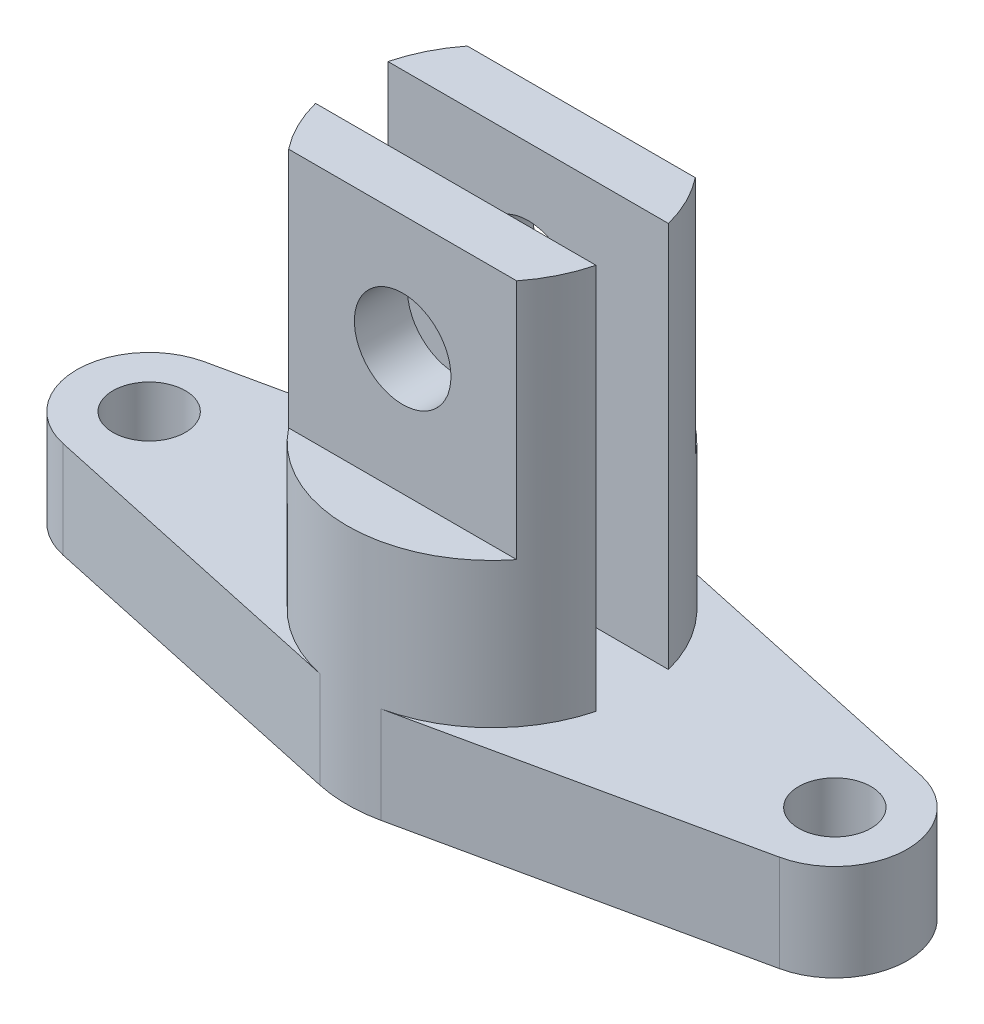
ISO-10303-21;
HEADER;
FILE_DESCRIPTION(('STEP AP214'),'2;1');
FILE_NAME('part.step','',(''),(''),'','','');
FILE_SCHEMA(('AUTOMOTIVE_DESIGN { 1 0 10303 214 1 1 1 1 }'));
ENDSEC;
DATA;
#1=APPLICATION_CONTEXT('core data for automotive mechanical design processes');
#2=APPLICATION_PROTOCOL_DEFINITION('international standard','automotive_design',2000,#1);
#3=PRODUCT_CONTEXT('',#1,'mechanical');
#4=PRODUCT('Part','Part','',(#3));
#5=PRODUCT_RELATED_PRODUCT_CATEGORY('part','',(#4));
#6=PRODUCT_DEFINITION_FORMATION('','',#4);
#7=PRODUCT_DEFINITION_CONTEXT('part definition',#1,'design');
#8=PRODUCT_DEFINITION('design','',#6,#7);
#9=PRODUCT_DEFINITION_SHAPE('','',#8);
#10=(LENGTH_UNIT() NAMED_UNIT(*) SI_UNIT(.MILLI.,.METRE.));
#11=(NAMED_UNIT(*) PLANE_ANGLE_UNIT() SI_UNIT($,.RADIAN.));
#12=(NAMED_UNIT(*) SI_UNIT($,.STERADIAN.) SOLID_ANGLE_UNIT());
#13=UNCERTAINTY_MEASURE_WITH_UNIT(LENGTH_MEASURE(1.E-05),#10,'distance_accuracy_value','');
#14=(GEOMETRIC_REPRESENTATION_CONTEXT(3) GLOBAL_UNCERTAINTY_ASSIGNED_CONTEXT((#13)) GLOBAL_UNIT_ASSIGNED_CONTEXT((#10,
#11,#12)) REPRESENTATION_CONTEXT('',''));
#15=CARTESIAN_POINT('',(0.,0.,0.));
#16=DIRECTION('',(0.,0.,1.));
#17=DIRECTION('',(1.,0.,0.));
#18=AXIS2_PLACEMENT_3D('',#15,#16,#17);
#19=CARTESIAN_POINT('',(71.,20.,-30.6927897427505));
#20=DIRECTION('',(0.,1.,0.));
#21=DIRECTION('',(0.,0.,1.));
#22=AXIS2_PLACEMENT_3D('',#19,#20,#21);
#23=PLANE('',#22);
#24=CARTESIAN_POINT('',(71.,20.,-30.6927897427505));
#25=DIRECTION('',(0.,1.,0.));
#26=DIRECTION('',(0.,0.,1.));
#27=AXIS2_PLACEMENT_3D('',#24,#25,#26);
#28=CIRCLE('',#27,7.50000000000001);
#29=CARTESIAN_POINT('',(71.,20.,-23.1927897427505));
#30=VERTEX_POINT('',#29);
#31=EDGE_CURVE('E221',#30,#30,#28,.T.);
#32=ORIENTED_EDGE('',*,*,#31,.F.);
#33=EDGE_LOOP('',(#32));
#34=FACE_BOUND('',#33,.T.);
#35=CARTESIAN_POINT('',(-71.,20.,-30.6927897427505));
#36=DIRECTION('',(0.,1.,0.));
#37=DIRECTION('',(0.,0.,1.));
#38=AXIS2_PLACEMENT_3D('',#35,#36,#37);
#39=CIRCLE('',#38,7.50000000000001);
#40=CARTESIAN_POINT('',(-71.,20.,-23.1927897427505));
#41=VERTEX_POINT('',#40);
#42=EDGE_CURVE('E215',#41,#41,#39,.T.);
#43=ORIENTED_EDGE('',*,*,#42,.F.);
#44=EDGE_LOOP('',(#43));
#45=FACE_BOUND('',#44,.T.);
#46=DIRECTION('',(1.,0.,0.));
#47=VECTOR('',#46,1.);
#48=CARTESIAN_POINT('',(-29.0473750965556,20.,-38.1927897427505));
#49=LINE('',#48,#47);
#50=CARTESIAN_POINT('',(-29.0473750965556,20.,-38.1927897427505));
#51=VERTEX_POINT('',#50);
#52=CARTESIAN_POINT('',(29.0473750965556,20.,-38.1927897427505));
#53=VERTEX_POINT('',#52);
#54=EDGE_CURVE('E190',#51,#53,#49,.T.);
#55=ORIENTED_EDGE('',*,*,#54,.F.);
#56=CARTESIAN_POINT('',(0.,20.,-30.6927897427505));
#57=DIRECTION('',(0.,1.,0.));
#58=DIRECTION('',(0.,0.,1.));
#59=AXIS2_PLACEMENT_3D('',#56,#57,#58);
#60=CIRCLE('',#59,30.);
#61=CARTESIAN_POINT('',(-6.33802816901409,20.,-60.0156374715913));
#62=VERTEX_POINT('',#61);
#63=EDGE_CURVE('E165',#62,#51,#60,.T.);
#64=ORIENTED_EDGE('',*,*,#63,.F.);
#65=DIRECTION('',(-0.977428257628027,0.,0.211267605633803));
#66=VECTOR('',#65,1.);
#67=CARTESIAN_POINT('',(-6.33802816901409,20.,-60.0156374715913));
#68=LINE('',#67,#66);
#69=CARTESIAN_POINT('',(-74.169014084507,20.,-45.3542136071709));
#70=VERTEX_POINT('',#69);
#71=EDGE_CURVE('E233',#62,#70,#68,.T.);
#72=ORIENTED_EDGE('',*,*,#71,.T.);
#73=CARTESIAN_POINT('',(-71.,20.,-30.6927897427505));
#74=DIRECTION('',(0.,1.,0.));
#75=DIRECTION('',(0.,0.,1.));
#76=AXIS2_PLACEMENT_3D('',#73,#74,#75);
#77=CIRCLE('',#76,15.);
#78=CARTESIAN_POINT('',(-74.169014084507,20.,-16.0313658783301));
#79=VERTEX_POINT('',#78);
#80=EDGE_CURVE('E235',#70,#79,#77,.T.);
#81=ORIENTED_EDGE('',*,*,#80,.T.);
#82=DIRECTION('',(0.977428257628027,0.,0.211267605633803));
#83=VECTOR('',#82,1.);
#84=CARTESIAN_POINT('',(-74.169014084507,20.,-16.0313658783301));
#85=LINE('',#84,#83);
#86=CARTESIAN_POINT('',(-6.33802816901408,20.,-1.36994201390971));
#87=VERTEX_POINT('',#86);
#88=EDGE_CURVE('E237',#79,#87,#85,.T.);
#89=ORIENTED_EDGE('',*,*,#88,.T.);
#90=CARTESIAN_POINT('',(0.,20.,-30.6927897427505));
#91=DIRECTION('',(0.,1.,0.));
#92=DIRECTION('',(0.,0.,1.));
#93=AXIS2_PLACEMENT_3D('',#90,#91,#92);
#94=CIRCLE('',#93,30.);
#95=CARTESIAN_POINT('',(-29.0473750965556,20.,-23.1927897427505));
#96=VERTEX_POINT('',#95);
#97=EDGE_CURVE('E43',#96,#87,#94,.T.);
#98=ORIENTED_EDGE('',*,*,#97,.F.);
#99=DIRECTION('',(-1.,0.,0.));
#100=VECTOR('',#99,1.);
#101=CARTESIAN_POINT('',(-29.0473750965556,20.,-23.1927897427505));
#102=LINE('',#101,#100);
#103=CARTESIAN_POINT('',(29.0473750965556,20.,-23.1927897427505));
#104=VERTEX_POINT('',#103);
#105=EDGE_CURVE('E206',#104,#96,#102,.T.);
#106=ORIENTED_EDGE('',*,*,#105,.F.);
#107=CARTESIAN_POINT('',(6.33802816901408,20.,-1.36994201390972));
#108=VERTEX_POINT('',#107);
#109=EDGE_CURVE('E11',#108,#104,#94,.T.);
#110=ORIENTED_EDGE('',*,*,#109,.F.);
#111=DIRECTION('',(0.977428257628027,0.,-0.211267605633803));
#112=VECTOR('',#111,1.);
#113=CARTESIAN_POINT('',(6.33802816901408,20.,-1.36994201390972));
#114=LINE('',#113,#112);
#115=CARTESIAN_POINT('',(74.1690140845071,20.,-16.0313658783301));
#116=VERTEX_POINT('',#115);
#117=EDGE_CURVE('E239',#108,#116,#114,.T.);
#118=ORIENTED_EDGE('',*,*,#117,.T.);
#119=CARTESIAN_POINT('',(71.,20.,-30.6927897427505));
#120=DIRECTION('',(0.,1.,0.));
#121=DIRECTION('',(0.,0.,1.));
#122=AXIS2_PLACEMENT_3D('',#119,#120,#121);
#123=CIRCLE('',#122,15.);
#124=CARTESIAN_POINT('',(74.1690140845071,20.,-45.3542136071709));
#125=VERTEX_POINT('',#124);
#126=EDGE_CURVE('E227',#116,#125,#123,.T.);
#127=ORIENTED_EDGE('',*,*,#126,.T.);
#128=DIRECTION('',(-0.977428257628027,0.,-0.211267605633803));
#129=VECTOR('',#128,1.);
#130=CARTESIAN_POINT('',(74.1690140845071,20.,-45.3542136071709));
#131=LINE('',#130,#129);
#132=CARTESIAN_POINT('',(6.33802816901408,20.,-60.0156374715913));
#133=VERTEX_POINT('',#132);
#134=EDGE_CURVE('E230',#125,#133,#131,.T.);
#135=ORIENTED_EDGE('',*,*,#134,.T.);
#136=EDGE_CURVE('E187',#53,#133,#60,.T.);
#137=ORIENTED_EDGE('',*,*,#136,.F.);
#138=EDGE_LOOP('',(#55,#64,#72,#81,#89,#98,#106,#110,#118,#127,#135,#137));
#139=FACE_BOUND('',#138,.T.);
#140=ADVANCED_FACE('F33',(#34,#45,#139),#23,.T.);
#141=CARTESIAN_POINT('',(71.,0.,-30.6927897427505));
#142=DIRECTION('',(0.,1.,0.));
#143=DIRECTION('',(0.,0.,1.));
#144=AXIS2_PLACEMENT_3D('',#141,#142,#143);
#145=PLANE('',#144);
#146=CARTESIAN_POINT('',(71.,0.,-30.6927897427505));
#147=DIRECTION('',(0.,1.,0.));
#148=DIRECTION('',(0.,0.,1.));
#149=AXIS2_PLACEMENT_3D('',#146,#147,#148);
#150=CIRCLE('',#149,15.);
#151=CARTESIAN_POINT('',(74.1690140845071,0.,-16.0313658783301));
#152=VERTEX_POINT('',#151);
#153=CARTESIAN_POINT('',(74.1690140845071,0.,-45.3542136071709));
#154=VERTEX_POINT('',#153);
#155=EDGE_CURVE('E224',#152,#154,#150,.T.);
#156=ORIENTED_EDGE('',*,*,#155,.F.);
#157=DIRECTION('',(0.977428257628027,0.,-0.211267605633803));
#158=VECTOR('',#157,1.);
#159=CARTESIAN_POINT('',(6.33802816901408,0.,-1.36994201390972));
#160=LINE('',#159,#158);
#161=CARTESIAN_POINT('',(6.33802816901408,0.,-1.36994201390972));
#162=VERTEX_POINT('',#161);
#163=EDGE_CURVE('E231',#162,#152,#160,.T.);
#164=ORIENTED_EDGE('',*,*,#163,.F.);
#165=CARTESIAN_POINT('',(0.,0.,-30.6927897427505));
#166=DIRECTION('',(0.,1.,0.));
#167=DIRECTION('',(0.,0.,-1.));
#168=AXIS2_PLACEMENT_3D('',#165,#166,#167);
#169=CIRCLE('',#168,30.);
#170=CARTESIAN_POINT('',(-6.33802816901408,0.,-1.36994201390971));
#171=VERTEX_POINT('',#170);
#172=EDGE_CURVE('E254',#171,#162,#169,.T.);
#173=ORIENTED_EDGE('',*,*,#172,.F.);
#174=DIRECTION('',(0.977428257628027,0.,0.211267605633803));
#175=VECTOR('',#174,1.);
#176=CARTESIAN_POINT('',(-74.169014084507,0.,-16.0313658783301));
#177=LINE('',#176,#175);
#178=CARTESIAN_POINT('',(-74.169014084507,0.,-16.0313658783301));
#179=VERTEX_POINT('',#178);
#180=EDGE_CURVE('E252',#179,#171,#177,.T.);
#181=ORIENTED_EDGE('',*,*,#180,.F.);
#182=CARTESIAN_POINT('',(-71.,0.,-30.6927897427505));
#183=DIRECTION('',(0.,1.,0.));
#184=DIRECTION('',(0.,0.,1.));
#185=AXIS2_PLACEMENT_3D('',#182,#183,#184);
#186=CIRCLE('',#185,15.);
#187=CARTESIAN_POINT('',(-74.169014084507,0.,-45.3542136071709));
#188=VERTEX_POINT('',#187);
#189=EDGE_CURVE('E250',#188,#179,#186,.T.);
#190=ORIENTED_EDGE('',*,*,#189,.F.);
#191=DIRECTION('',(-0.977428257628027,0.,0.211267605633803));
#192=VECTOR('',#191,1.);
#193=CARTESIAN_POINT('',(-6.33802816901409,0.,-60.0156374715913));
#194=LINE('',#193,#192);
#195=CARTESIAN_POINT('',(-6.33802816901409,0.,-60.0156374715913));
#196=VERTEX_POINT('',#195);
#197=EDGE_CURVE('E248',#196,#188,#194,.T.);
#198=ORIENTED_EDGE('',*,*,#197,.F.);
#199=CARTESIAN_POINT('',(0.,0.,-30.6927897427505));
#200=DIRECTION('',(0.,1.,0.));
#201=DIRECTION('',(0.,0.,1.));
#202=AXIS2_PLACEMENT_3D('',#199,#200,#201);
#203=CIRCLE('',#202,30.);
#204=CARTESIAN_POINT('',(6.33802816901408,0.,-60.0156374715913));
#205=VERTEX_POINT('',#204);
#206=EDGE_CURVE('E246',#205,#196,#203,.T.);
#207=ORIENTED_EDGE('',*,*,#206,.F.);
#208=DIRECTION('',(-0.977428257628027,0.,-0.211267605633803));
#209=VECTOR('',#208,1.);
#210=CARTESIAN_POINT('',(74.1690140845071,0.,-45.3542136071709));
#211=LINE('',#210,#209);
#212=EDGE_CURVE('E244',#154,#205,#211,.T.);
#213=ORIENTED_EDGE('',*,*,#212,.F.);
#214=EDGE_LOOP('',(#156,#164,#173,#181,#190,#198,#207,#213));
#215=FACE_BOUND('',#214,.T.);
#216=CARTESIAN_POINT('',(71.,0.,-30.6927897427505));
#217=DIRECTION('',(0.,1.,0.));
#218=DIRECTION('',(0.,0.,1.));
#219=AXIS2_PLACEMENT_3D('',#216,#217,#218);
#220=CIRCLE('',#219,7.50000000000001);
#221=CARTESIAN_POINT('',(71.,0.,-23.1927897427505));
#222=VERTEX_POINT('',#221);
#223=EDGE_CURVE('E218',#222,#222,#220,.T.);
#224=ORIENTED_EDGE('',*,*,#223,.T.);
#225=EDGE_LOOP('',(#224));
#226=FACE_BOUND('',#225,.T.);
#227=CARTESIAN_POINT('',(-71.,0.,-30.6927897427505));
#228=DIRECTION('',(0.,1.,0.));
#229=DIRECTION('',(0.,0.,1.));
#230=AXIS2_PLACEMENT_3D('',#227,#228,#229);
#231=CIRCLE('',#230,7.50000000000001);
#232=CARTESIAN_POINT('',(-71.,0.,-23.1927897427505));
#233=VERTEX_POINT('',#232);
#234=EDGE_CURVE('E214',#233,#233,#231,.T.);
#235=ORIENTED_EDGE('',*,*,#234,.T.);
#236=EDGE_LOOP('',(#235));
#237=FACE_BOUND('',#236,.T.);
#238=ADVANCED_FACE('F287',(#215,#226,#237),#145,.F.);
#239=CARTESIAN_POINT('',(71.,20.,-30.6927897427505));
#240=DIRECTION('',(0.,-1.,0.));
#241=DIRECTION('',(0.,0.,-1.));
#242=AXIS2_PLACEMENT_3D('',#239,#240,#241);
#243=CYLINDRICAL_SURFACE('',#242,15.);
#244=ORIENTED_EDGE('',*,*,#155,.T.);
#245=DIRECTION('',(0.,-1.,0.));
#246=VECTOR('',#245,1.);
#247=CARTESIAN_POINT('',(74.1690140845071,20.,-45.3542136071709));
#248=LINE('',#247,#246);
#249=EDGE_CURVE('E37',#125,#154,#248,.T.);
#250=ORIENTED_EDGE('',*,*,#249,.F.);
#251=ORIENTED_EDGE('',*,*,#126,.F.);
#252=DIRECTION('',(0.,-1.,0.));
#253=VECTOR('',#252,1.);
#254=CARTESIAN_POINT('',(74.1690140845071,20.,-16.0313658783301));
#255=LINE('',#254,#253);
#256=EDGE_CURVE('E241',#116,#152,#255,.T.);
#257=ORIENTED_EDGE('',*,*,#256,.T.);
#258=EDGE_LOOP('',(#244,#250,#251,#257));
#259=FACE_BOUND('',#258,.T.);
#260=ADVANCED_FACE('F35',(#259),#243,.T.);
#261=CARTESIAN_POINT('',(74.1690140845071,20.,-45.3542136071709));
#262=DIRECTION('',(-0.211267605633803,0.,0.977428257628027));
#263=DIRECTION('',(0.977428257628027,0.,0.211267605633803));
#264=AXIS2_PLACEMENT_3D('',#261,#262,#263);
#265=PLANE('',#264);
#266=ORIENTED_EDGE('',*,*,#212,.T.);
#267=DIRECTION('',(0.,-1.,0.));
#268=VECTOR('',#267,1.);
#269=CARTESIAN_POINT('',(6.33802816901408,20.,-60.0156374715913));
#270=LINE('',#269,#268);
#271=EDGE_CURVE('E273',#133,#205,#270,.T.);
#272=ORIENTED_EDGE('',*,*,#271,.F.);
#273=ORIENTED_EDGE('',*,*,#134,.F.);
#274=ORIENTED_EDGE('',*,*,#249,.T.);
#275=EDGE_LOOP('',(#266,#272,#273,#274));
#276=FACE_BOUND('',#275,.T.);
#277=ADVANCED_FACE('F280',(#276),#265,.F.);
#278=CARTESIAN_POINT('',(0.,20.,-30.6927897427505));
#279=DIRECTION('',(0.,-1.,0.));
#280=DIRECTION('',(0.,0.,-1.));
#281=AXIS2_PLACEMENT_3D('',#278,#279,#280);
#282=CYLINDRICAL_SURFACE('',#281,30.);
#283=CARTESIAN_POINT('',(0.,100.,-30.6927897427505));
#284=DIRECTION('',(0.,1.,0.));
#285=DIRECTION('',(0.,0.,1.));
#286=AXIS2_PLACEMENT_3D('',#283,#284,#285);
#287=CIRCLE('',#286,30.);
#288=CARTESIAN_POINT('',(-23.6167313572391,100.,-49.1927897427505));
#289=VERTEX_POINT('',#288);
#290=CARTESIAN_POINT('',(-29.0473750965556,100.,-38.1927897427505));
#291=VERTEX_POINT('',#290);
#292=EDGE_CURVE('E163',#289,#291,#287,.T.);
#293=ORIENTED_EDGE('',*,*,#292,.F.);
#294=DIRECTION('',(0.,1.,0.));
#295=VECTOR('',#294,1.);
#296=CARTESIAN_POINT('',(-23.6167313572391,50.,-49.1927897427505));
#297=LINE('',#296,#295);
#298=CARTESIAN_POINT('',(-23.6167313572391,50.,-49.1927897427505));
#299=VERTEX_POINT('',#298);
#300=EDGE_CURVE('E58',#299,#289,#297,.T.);
#301=ORIENTED_EDGE('',*,*,#300,.F.);
#302=CARTESIAN_POINT('',(0.,50.,-30.6927897427505));
#303=DIRECTION('',(0.,1.,0.));
#304=DIRECTION('',(0.,0.,1.));
#305=AXIS2_PLACEMENT_3D('',#302,#303,#304);
#306=CIRCLE('',#305,30.);
#307=CARTESIAN_POINT('',(23.6167313572391,50.,-49.1927897427505));
#308=VERTEX_POINT('',#307);
#309=EDGE_CURVE('E150',#308,#299,#306,.T.);
#310=ORIENTED_EDGE('',*,*,#309,.F.);
#311=DIRECTION('',(0.,1.,0.));
#312=VECTOR('',#311,1.);
#313=CARTESIAN_POINT('',(23.6167313572391,50.,-49.1927897427505));
#314=LINE('',#313,#312);
#315=CARTESIAN_POINT('',(23.6167313572391,100.,-49.1927897427505));
#316=VERTEX_POINT('',#315);
#317=EDGE_CURVE('E158',#308,#316,#314,.T.);
#318=ORIENTED_EDGE('',*,*,#317,.T.);
#319=CARTESIAN_POINT('',(29.0473750965556,100.,-38.1927897427505));
#320=VERTEX_POINT('',#319);
#321=EDGE_CURVE('E181',#320,#316,#287,.T.);
#322=ORIENTED_EDGE('',*,*,#321,.F.);
#323=DIRECTION('',(0.,-1.,0.));
#324=VECTOR('',#323,1.);
#325=CARTESIAN_POINT('',(29.0473750965556,100.,-38.1927897427505));
#326=LINE('',#325,#324);
#327=EDGE_CURVE('E186',#320,#53,#326,.T.);
#328=ORIENTED_EDGE('',*,*,#327,.T.);
#329=ORIENTED_EDGE('',*,*,#136,.T.);
#330=ORIENTED_EDGE('',*,*,#271,.T.);
#331=ORIENTED_EDGE('',*,*,#206,.T.);
#332=DIRECTION('',(0.,-1.,0.));
#333=VECTOR('',#332,1.);
#334=CARTESIAN_POINT('',(-6.33802816901409,20.,-60.0156374715913));
#335=LINE('',#334,#333);
#336=EDGE_CURVE('E271',#62,#196,#335,.T.);
#337=ORIENTED_EDGE('',*,*,#336,.F.);
#338=ORIENTED_EDGE('',*,*,#63,.T.);
#339=DIRECTION('',(0.,-1.,0.));
#340=VECTOR('',#339,1.);
#341=CARTESIAN_POINT('',(-29.0473750965556,100.,-38.1927897427505));
#342=LINE('',#341,#340);
#343=EDGE_CURVE('E195',#291,#51,#342,.T.);
#344=ORIENTED_EDGE('',*,*,#343,.F.);
#345=EDGE_LOOP('',(#293,#301,#310,#318,#322,#328,#329,#330,#331,#337,#338,#344));
#346=FACE_BOUND('',#345,.T.);
#347=ADVANCED_FACE('F161',(#346),#282,.T.);
#348=CARTESIAN_POINT('',(-6.33802816901409,20.,-60.0156374715913));
#349=DIRECTION('',(0.211267605633803,0.,0.977428257628027));
#350=DIRECTION('',(0.977428257628027,0.,-0.211267605633803));
#351=AXIS2_PLACEMENT_3D('',#348,#349,#350);
#352=PLANE('',#351);
#353=ORIENTED_EDGE('',*,*,#197,.T.);
#354=DIRECTION('',(0.,-1.,0.));
#355=VECTOR('',#354,1.);
#356=CARTESIAN_POINT('',(-74.169014084507,20.,-45.3542136071709));
#357=LINE('',#356,#355);
#358=EDGE_CURVE('E268',#70,#188,#357,.T.);
#359=ORIENTED_EDGE('',*,*,#358,.F.);
#360=ORIENTED_EDGE('',*,*,#71,.F.);
#361=ORIENTED_EDGE('',*,*,#336,.T.);
#362=EDGE_LOOP('',(#353,#359,#360,#361));
#363=FACE_BOUND('',#362,.T.);
#364=ADVANCED_FACE('F296',(#363),#352,.F.);
#365=CARTESIAN_POINT('',(-71.,20.,-30.6927897427505));
#366=DIRECTION('',(0.,-1.,0.));
#367=DIRECTION('',(0.,0.,-1.));
#368=AXIS2_PLACEMENT_3D('',#365,#366,#367);
#369=CYLINDRICAL_SURFACE('',#368,15.);
#370=ORIENTED_EDGE('',*,*,#189,.T.);
#371=DIRECTION('',(0.,-1.,0.));
#372=VECTOR('',#371,1.);
#373=CARTESIAN_POINT('',(-74.169014084507,20.,-16.0313658783301));
#374=LINE('',#373,#372);
#375=EDGE_CURVE('E265',#79,#179,#374,.T.);
#376=ORIENTED_EDGE('',*,*,#375,.F.);
#377=ORIENTED_EDGE('',*,*,#80,.F.);
#378=ORIENTED_EDGE('',*,*,#358,.T.);
#379=EDGE_LOOP('',(#370,#376,#377,#378));
#380=FACE_BOUND('',#379,.T.);
#381=ADVANCED_FACE('F487',(#380),#369,.T.);
#382=CARTESIAN_POINT('',(-74.169014084507,20.,-16.0313658783301));
#383=DIRECTION('',(0.211267605633803,0.,-0.977428257628027));
#384=DIRECTION('',(-0.977428257628027,0.,-0.211267605633803));
#385=AXIS2_PLACEMENT_3D('',#382,#383,#384);
#386=PLANE('',#385);
#387=ORIENTED_EDGE('',*,*,#180,.T.);
#388=DIRECTION('',(0.,-1.,0.));
#389=VECTOR('',#388,1.);
#390=CARTESIAN_POINT('',(-6.33802816901408,20.,-1.36994201390971));
#391=LINE('',#390,#389);
#392=EDGE_CURVE('E262',#87,#171,#391,.T.);
#393=ORIENTED_EDGE('',*,*,#392,.F.);
#394=ORIENTED_EDGE('',*,*,#88,.F.);
#395=ORIENTED_EDGE('',*,*,#375,.T.);
#396=EDGE_LOOP('',(#387,#393,#394,#395));
#397=FACE_BOUND('',#396,.T.);
#398=ADVANCED_FACE('F343',(#397),#386,.F.);
#399=CARTESIAN_POINT('',(0.,20.,-30.6927897427505));
#400=DIRECTION('',(0.,-1.,0.));
#401=DIRECTION('',(0.,0.,-1.));
#402=AXIS2_PLACEMENT_3D('',#399,#400,#401);
#403=CYLINDRICAL_SURFACE('',#402,30.);
#404=CARTESIAN_POINT('',(0.,100.,-30.6927897427505));
#405=DIRECTION('',(0.,1.,0.));
#406=DIRECTION('',(0.,0.,1.));
#407=AXIS2_PLACEMENT_3D('',#404,#405,#406);
#408=CIRCLE('',#407,30.);
#409=CARTESIAN_POINT('',(23.6167313572391,100.,-12.1927897427505));
#410=VERTEX_POINT('',#409);
#411=CARTESIAN_POINT('',(29.0473750965556,100.,-23.1927897427505));
#412=VERTEX_POINT('',#411);
#413=EDGE_CURVE('E202',#410,#412,#408,.T.);
#414=ORIENTED_EDGE('',*,*,#413,.F.);
#415=DIRECTION('',(0.,1.,0.));
#416=VECTOR('',#415,1.);
#417=CARTESIAN_POINT('',(23.6167313572391,50.,-12.1927897427505));
#418=LINE('',#417,#416);
#419=CARTESIAN_POINT('',(23.6167313572391,50.,-12.1927897427505));
#420=VERTEX_POINT('',#419);
#421=EDGE_CURVE('E50',#420,#410,#418,.T.);
#422=ORIENTED_EDGE('',*,*,#421,.F.);
#423=CARTESIAN_POINT('',(0.,50.,-30.6927897427505));
#424=DIRECTION('',(0.,1.,0.));
#425=DIRECTION('',(0.,0.,1.));
#426=AXIS2_PLACEMENT_3D('',#423,#424,#425);
#427=CIRCLE('',#426,30.);
#428=CARTESIAN_POINT('',(-23.6167313572391,50.,-12.1927897427505));
#429=VERTEX_POINT('',#428);
#430=EDGE_CURVE('E169',#429,#420,#427,.T.);
#431=ORIENTED_EDGE('',*,*,#430,.F.);
#432=DIRECTION('',(0.,1.,0.));
#433=VECTOR('',#432,1.);
#434=CARTESIAN_POINT('',(-23.6167313572391,50.,-12.1927897427505));
#435=LINE('',#434,#433);
#436=CARTESIAN_POINT('',(-23.6167313572391,100.,-12.1927897427505));
#437=VERTEX_POINT('',#436);
#438=EDGE_CURVE('E177',#429,#437,#435,.T.);
#439=ORIENTED_EDGE('',*,*,#438,.T.);
#440=CARTESIAN_POINT('',(-29.0473750965556,100.,-23.1927897427505));
#441=VERTEX_POINT('',#440);
#442=EDGE_CURVE('E198',#441,#437,#408,.T.);
#443=ORIENTED_EDGE('',*,*,#442,.F.);
#444=DIRECTION('',(0.,-1.,0.));
#445=VECTOR('',#444,1.);
#446=CARTESIAN_POINT('',(-29.0473750965556,100.,-23.1927897427505));
#447=LINE('',#446,#445);
#448=EDGE_CURVE('E203',#441,#96,#447,.T.);
#449=ORIENTED_EDGE('',*,*,#448,.T.);
#450=ORIENTED_EDGE('',*,*,#97,.T.);
#451=ORIENTED_EDGE('',*,*,#392,.T.);
#452=ORIENTED_EDGE('',*,*,#172,.T.);
#453=DIRECTION('',(0.,-1.,0.));
#454=VECTOR('',#453,1.);
#455=CARTESIAN_POINT('',(6.33802816901408,20.,-1.36994201390972));
#456=LINE('',#455,#454);
#457=EDGE_CURVE('E259',#108,#162,#456,.T.);
#458=ORIENTED_EDGE('',*,*,#457,.F.);
#459=ORIENTED_EDGE('',*,*,#109,.T.);
#460=DIRECTION('',(0.,-1.,0.));
#461=VECTOR('',#460,1.);
#462=CARTESIAN_POINT('',(29.0473750965556,100.,-23.1927897427505));
#463=LINE('',#462,#461);
#464=EDGE_CURVE('E211',#412,#104,#463,.T.);
#465=ORIENTED_EDGE('',*,*,#464,.F.);
#466=EDGE_LOOP('',(#414,#422,#431,#439,#443,#449,#450,#451,#452,#458,#459,#465));
#467=FACE_BOUND('',#466,.T.);
#468=ADVANCED_FACE('F333',(#467),#403,.T.);
#469=CARTESIAN_POINT('',(6.33802816901408,20.,-1.36994201390972));
#470=DIRECTION('',(-0.211267605633803,0.,-0.977428257628027));
#471=DIRECTION('',(-0.977428257628027,0.,0.211267605633803));
#472=AXIS2_PLACEMENT_3D('',#469,#470,#471);
#473=PLANE('',#472);
#474=ORIENTED_EDGE('',*,*,#163,.T.);
#475=ORIENTED_EDGE('',*,*,#256,.F.);
#476=ORIENTED_EDGE('',*,*,#117,.F.);
#477=ORIENTED_EDGE('',*,*,#457,.T.);
#478=EDGE_LOOP('',(#474,#475,#476,#477));
#479=FACE_BOUND('',#478,.T.);
#480=ADVANCED_FACE('F348',(#479),#473,.F.);
#481=CARTESIAN_POINT('',(71.,20.,-30.6927897427505));
#482=DIRECTION('',(0.,-1.,0.));
#483=DIRECTION('',(0.,0.,-1.));
#484=AXIS2_PLACEMENT_3D('',#481,#482,#483);
#485=CYLINDRICAL_SURFACE('',#484,7.50000000000001);
#486=ORIENTED_EDGE('',*,*,#31,.T.);
#487=EDGE_LOOP('',(#486));
#488=FACE_BOUND('',#487,.T.);
#489=ORIENTED_EDGE('',*,*,#223,.F.);
#490=EDGE_LOOP('',(#489));
#491=FACE_BOUND('',#490,.T.);
#492=ADVANCED_FACE('F350',(#488,#491),#485,.F.);
#493=CARTESIAN_POINT('',(-71.,20.,-30.6927897427505));
#494=DIRECTION('',(0.,-1.,0.));
#495=DIRECTION('',(0.,0.,-1.));
#496=AXIS2_PLACEMENT_3D('',#493,#494,#495);
#497=CYLINDRICAL_SURFACE('',#496,7.50000000000001);
#498=ORIENTED_EDGE('',*,*,#42,.T.);
#499=EDGE_LOOP('',(#498));
#500=FACE_BOUND('',#499,.T.);
#501=ORIENTED_EDGE('',*,*,#234,.F.);
#502=EDGE_LOOP('',(#501));
#503=FACE_BOUND('',#502,.T.);
#504=ADVANCED_FACE('F356',(#500,#503),#497,.F.);
#505=CARTESIAN_POINT('',(-29.0473750965556,100.,-23.1927897427505));
#506=DIRECTION('',(0.,0.,1.));
#507=DIRECTION('',(1.,0.,0.));
#508=AXIS2_PLACEMENT_3D('',#505,#506,#507);
#509=PLANE('',#508);
#510=CARTESIAN_POINT('',(0.,76.,-23.1927897427505));
#511=DIRECTION('',(0.,0.,1.));
#512=DIRECTION('',(1.,0.,0.));
#513=AXIS2_PLACEMENT_3D('',#510,#511,#512);
#514=CIRCLE('',#513,10.);
#515=CARTESIAN_POINT('',(10.,76.,-23.1927897427505));
#516=VERTEX_POINT('',#515);
#517=EDGE_CURVE('E176',#516,#516,#514,.T.);
#518=ORIENTED_EDGE('',*,*,#517,.T.);
#519=EDGE_LOOP('',(#518));
#520=FACE_BOUND('',#519,.T.);
#521=ORIENTED_EDGE('',*,*,#105,.T.);
#522=ORIENTED_EDGE('',*,*,#448,.F.);
#523=DIRECTION('',(-1.,0.,0.));
#524=VECTOR('',#523,1.);
#525=CARTESIAN_POINT('',(-29.0473750965556,100.,-23.1927897427505));
#526=LINE('',#525,#524);
#527=EDGE_CURVE('E201',#412,#441,#526,.T.);
#528=ORIENTED_EDGE('',*,*,#527,.F.);
#529=ORIENTED_EDGE('',*,*,#464,.T.);
#530=EDGE_LOOP('',(#521,#522,#528,#529));
#531=FACE_BOUND('',#530,.T.);
#532=ADVANCED_FACE('F339',(#520,#531),#509,.F.);
#533=CARTESIAN_POINT('',(0.,100.,-30.6927897427505));
#534=DIRECTION('',(0.,1.,0.));
#535=DIRECTION('',(0.,0.,1.));
#536=AXIS2_PLACEMENT_3D('',#533,#534,#535);
#537=PLANE('',#536);
#538=DIRECTION('',(-1.,0.,0.));
#539=VECTOR('',#538,1.);
#540=CARTESIAN_POINT('',(-23.6167313572391,100.,-12.1927897427505));
#541=LINE('',#540,#539);
#542=EDGE_CURVE('E172',#410,#437,#541,.T.);
#543=ORIENTED_EDGE('',*,*,#542,.F.);
#544=ORIENTED_EDGE('',*,*,#413,.T.);
#545=ORIENTED_EDGE('',*,*,#527,.T.);
#546=ORIENTED_EDGE('',*,*,#442,.T.);
#547=EDGE_LOOP('',(#543,#544,#545,#546));
#548=FACE_BOUND('',#547,.T.);
#549=ADVANCED_FACE('F334',(#548),#537,.T.);
#550=CARTESIAN_POINT('',(-29.0473750965556,100.,-38.1927897427505));
#551=DIRECTION('',(0.,0.,-1.));
#552=DIRECTION('',(-1.,0.,0.));
#553=AXIS2_PLACEMENT_3D('',#550,#551,#552);
#554=PLANE('',#553);
#555=CARTESIAN_POINT('',(0.,76.,-38.1927897427505));
#556=DIRECTION('',(0.,0.,-1.));
#557=DIRECTION('',(-1.,0.,0.));
#558=AXIS2_PLACEMENT_3D('',#555,#556,#557);
#559=CIRCLE('',#558,10.);
#560=CARTESIAN_POINT('',(-10.,76.,-38.1927897427505));
#561=VERTEX_POINT('',#560);
#562=EDGE_CURVE('E311',#561,#561,#559,.T.);
#563=ORIENTED_EDGE('',*,*,#562,.T.);
#564=EDGE_LOOP('',(#563));
#565=FACE_BOUND('',#564,.T.);
#566=ORIENTED_EDGE('',*,*,#54,.T.);
#567=ORIENTED_EDGE('',*,*,#327,.F.);
#568=DIRECTION('',(1.,0.,0.));
#569=VECTOR('',#568,1.);
#570=CARTESIAN_POINT('',(-29.0473750965556,100.,-38.1927897427505));
#571=LINE('',#570,#569);
#572=EDGE_CURVE('E184',#291,#320,#571,.T.);
#573=ORIENTED_EDGE('',*,*,#572,.F.);
#574=ORIENTED_EDGE('',*,*,#343,.T.);
#575=EDGE_LOOP('',(#566,#567,#573,#574));
#576=FACE_BOUND('',#575,.T.);
#577=ADVANCED_FACE('F303',(#565,#576),#554,.F.);
#578=CARTESIAN_POINT('',(0.,100.,-30.6927897427505));
#579=DIRECTION('',(0.,1.,0.));
#580=DIRECTION('',(0.,0.,1.));
#581=AXIS2_PLACEMENT_3D('',#578,#579,#580);
#582=PLANE('',#581);
#583=DIRECTION('',(1.,0.,0.));
#584=VECTOR('',#583,1.);
#585=CARTESIAN_POINT('',(-23.6167313572391,100.,-49.1927897427505));
#586=LINE('',#585,#584);
#587=EDGE_CURVE('E155',#289,#316,#586,.T.);
#588=ORIENTED_EDGE('',*,*,#587,.F.);
#589=ORIENTED_EDGE('',*,*,#292,.T.);
#590=ORIENTED_EDGE('',*,*,#572,.T.);
#591=ORIENTED_EDGE('',*,*,#321,.T.);
#592=EDGE_LOOP('',(#588,#589,#590,#591));
#593=FACE_BOUND('',#592,.T.);
#594=ADVANCED_FACE('F307',(#593),#582,.T.);
#595=CARTESIAN_POINT('',(-23.6167313572391,50.,-49.1927897427505));
#596=DIRECTION('',(0.,0.,1.));
#597=DIRECTION('',(1.,0.,0.));
#598=AXIS2_PLACEMENT_3D('',#595,#596,#597);
#599=PLANE('',#598);
#600=CARTESIAN_POINT('',(0.,76.,-49.1927897427505));
#601=DIRECTION('',(0.,0.,1.));
#602=DIRECTION('',(1.,0.,0.));
#603=AXIS2_PLACEMENT_3D('',#600,#601,#602);
#604=CIRCLE('',#603,10.);
#605=CARTESIAN_POINT('',(10.,76.,-49.1927897427505));
#606=VERTEX_POINT('',#605);
#607=EDGE_CURVE('E314',#606,#606,#604,.F.);
#608=ORIENTED_EDGE('',*,*,#607,.F.);
#609=EDGE_LOOP('',(#608));
#610=FACE_BOUND('',#609,.T.);
#611=ORIENTED_EDGE('',*,*,#587,.T.);
#612=ORIENTED_EDGE('',*,*,#317,.F.);
#613=DIRECTION('',(1.,0.,0.));
#614=VECTOR('',#613,1.);
#615=CARTESIAN_POINT('',(-23.6167313572391,50.,-49.1927897427505));
#616=LINE('',#615,#614);
#617=EDGE_CURVE('E152',#299,#308,#616,.T.);
#618=ORIENTED_EDGE('',*,*,#617,.F.);
#619=ORIENTED_EDGE('',*,*,#300,.T.);
#620=EDGE_LOOP('',(#611,#612,#618,#619));
#621=FACE_BOUND('',#620,.T.);
#622=ADVANCED_FACE('F157',(#610,#621),#599,.F.);
#623=CARTESIAN_POINT('',(0.,50.,-30.6927897427505));
#624=DIRECTION('',(0.,1.,0.));
#625=DIRECTION('',(0.,0.,1.));
#626=AXIS2_PLACEMENT_3D('',#623,#624,#625);
#627=PLANE('',#626);
#628=ORIENTED_EDGE('',*,*,#309,.T.);
#629=ORIENTED_EDGE('',*,*,#617,.T.);
#630=EDGE_LOOP('',(#628,#629));
#631=FACE_BOUND('',#630,.T.);
#632=ADVANCED_FACE('F151',(#631),#627,.T.);
#633=CARTESIAN_POINT('',(-23.6167313572391,50.,-12.1927897427505));
#634=DIRECTION('',(0.,0.,-1.));
#635=DIRECTION('',(-1.,0.,0.));
#636=AXIS2_PLACEMENT_3D('',#633,#634,#635);
#637=PLANE('',#636);
#638=CARTESIAN_POINT('',(0.,76.,-12.1927897427505));
#639=DIRECTION('',(0.,0.,1.));
#640=DIRECTION('',(1.,0.,0.));
#641=AXIS2_PLACEMENT_3D('',#638,#639,#640);
#642=CIRCLE('',#641,10.);
#643=CARTESIAN_POINT('',(10.,76.,-12.1927897427505));
#644=VERTEX_POINT('',#643);
#645=EDGE_CURVE('E317',#644,#644,#642,.T.);
#646=ORIENTED_EDGE('',*,*,#645,.F.);
#647=EDGE_LOOP('',(#646));
#648=FACE_BOUND('',#647,.T.);
#649=ORIENTED_EDGE('',*,*,#542,.T.);
#650=ORIENTED_EDGE('',*,*,#438,.F.);
#651=DIRECTION('',(-1.,0.,0.));
#652=VECTOR('',#651,1.);
#653=CARTESIAN_POINT('',(-23.6167313572391,50.,-12.1927897427505));
#654=LINE('',#653,#652);
#655=EDGE_CURVE('E171',#420,#429,#654,.T.);
#656=ORIENTED_EDGE('',*,*,#655,.F.);
#657=ORIENTED_EDGE('',*,*,#421,.T.);
#658=EDGE_LOOP('',(#649,#650,#656,#657));
#659=FACE_BOUND('',#658,.T.);
#660=ADVANCED_FACE('F324',(#648,#659),#637,.F.);
#661=CARTESIAN_POINT('',(0.,50.,-30.6927897427505));
#662=DIRECTION('',(0.,1.,0.));
#663=DIRECTION('',(0.,0.,1.));
#664=AXIS2_PLACEMENT_3D('',#661,#662,#663);
#665=PLANE('',#664);
#666=ORIENTED_EDGE('',*,*,#430,.T.);
#667=ORIENTED_EDGE('',*,*,#655,.T.);
#668=EDGE_LOOP('',(#666,#667));
#669=FACE_BOUND('',#668,.T.);
#670=ADVANCED_FACE('F326',(#669),#665,.T.);
#671=CARTESIAN_POINT('',(0.,76.,-77.4770609902124));
#672=DIRECTION('',(0.,0.,1.));
#673=DIRECTION('',(1.,0.,0.));
#674=AXIS2_PLACEMENT_3D('',#671,#672,#673);
#675=CYLINDRICAL_SURFACE('',#674,10.);
#676=ORIENTED_EDGE('',*,*,#645,.T.);
#677=EDGE_LOOP('',(#676));
#678=FACE_BOUND('',#677,.T.);
#679=ORIENTED_EDGE('',*,*,#517,.F.);
#680=EDGE_LOOP('',(#679));
#681=FACE_BOUND('',#680,.T.);
#682=ADVANCED_FACE('F321',(#678,#681),#675,.F.);
#683=ORIENTED_EDGE('',*,*,#607,.T.);
#684=EDGE_LOOP('',(#683));
#685=FACE_BOUND('',#684,.T.);
#686=ORIENTED_EDGE('',*,*,#562,.F.);
#687=EDGE_LOOP('',(#686));
#688=FACE_BOUND('',#687,.T.);
#689=ADVANCED_FACE('F392',(#685,#688),#675,.F.);
#690=CLOSED_SHELL('',(#140,#238,#260,#277,#347,#364,#381,#398,#468,#480,#492,#504,#532,#549,
#577,#594,#622,#632,#660,#670,#682,#689));
#691=MANIFOLD_SOLID_BREP('B2',#690);
#692=ADVANCED_BREP_SHAPE_REPRESENTATION('',(#18,#691),#14);
#693=SHAPE_DEFINITION_REPRESENTATION(#9,#692);
ENDSEC;
END-ISO-10303-21;
